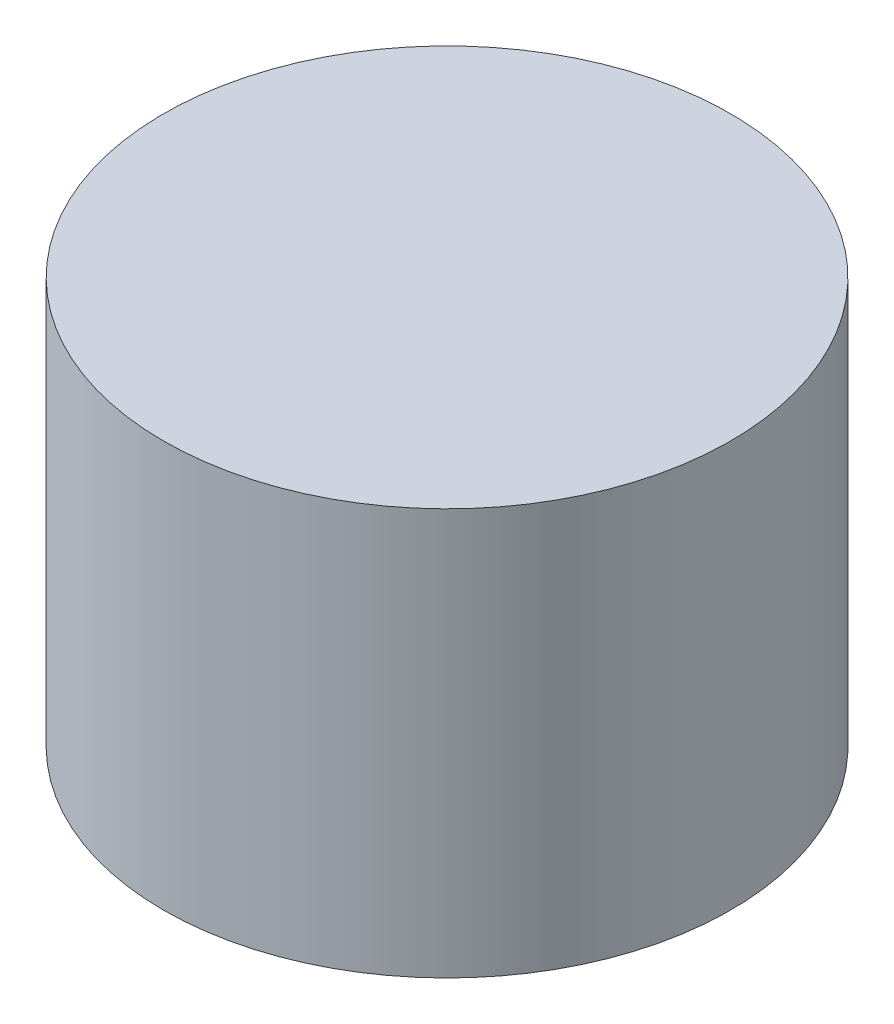
ISO-10303-21;
HEADER;
FILE_DESCRIPTION(('STEP AP214'),'2;1');
FILE_NAME('part.step','',(''),(''),'','','');
FILE_SCHEMA(('AUTOMOTIVE_DESIGN { 1 0 10303 214 1 1 1 1 }'));
ENDSEC;
DATA;
#1=APPLICATION_CONTEXT('core data for automotive mechanical design processes');
#2=APPLICATION_PROTOCOL_DEFINITION('international standard','automotive_design',2000,#1);
#3=PRODUCT_CONTEXT('',#1,'mechanical');
#4=PRODUCT('Part','Part','',(#3));
#5=PRODUCT_RELATED_PRODUCT_CATEGORY('part','',(#4));
#6=PRODUCT_DEFINITION_FORMATION('','',#4);
#7=PRODUCT_DEFINITION_CONTEXT('part definition',#1,'design');
#8=PRODUCT_DEFINITION('design','',#6,#7);
#9=PRODUCT_DEFINITION_SHAPE('','',#8);
#10=(LENGTH_UNIT() NAMED_UNIT(*) SI_UNIT(.MILLI.,.METRE.));
#11=(NAMED_UNIT(*) PLANE_ANGLE_UNIT() SI_UNIT($,.RADIAN.));
#12=(NAMED_UNIT(*) SI_UNIT($,.STERADIAN.) SOLID_ANGLE_UNIT());
#13=UNCERTAINTY_MEASURE_WITH_UNIT(LENGTH_MEASURE(1.E-05),#10,'distance_accuracy_value','');
#14=(GEOMETRIC_REPRESENTATION_CONTEXT(3) GLOBAL_UNCERTAINTY_ASSIGNED_CONTEXT((#13)) GLOBAL_UNIT_ASSIGNED_CONTEXT((#10,
#11,#12)) REPRESENTATION_CONTEXT('',''));
#15=CARTESIAN_POINT('',(0.,0.,0.));
#16=DIRECTION('',(0.,0.,1.));
#17=DIRECTION('',(1.,0.,0.));
#18=AXIS2_PLACEMENT_3D('',#15,#16,#17);
#19=CARTESIAN_POINT('',(0.,21.5,0.));
#20=DIRECTION('',(0.,-1.,0.));
#21=DIRECTION('',(0.,0.,-1.));
#22=AXIS2_PLACEMENT_3D('',#19,#20,#21);
#23=CYLINDRICAL_SURFACE('',#22,15.);
#24=CARTESIAN_POINT('',(0.,21.5,0.));
#25=DIRECTION('',(0.,1.,0.));
#26=DIRECTION('',(0.,0.,1.));
#27=AXIS2_PLACEMENT_3D('',#24,#25,#26);
#28=CIRCLE('',#27,15.);
#29=CARTESIAN_POINT('',(0.,21.5,15.));
#30=VERTEX_POINT('',#29);
#31=EDGE_CURVE('E10',#30,#30,#28,.T.);
#32=ORIENTED_EDGE('',*,*,#31,.F.);
#33=EDGE_LOOP('',(#32));
#34=FACE_BOUND('',#33,.T.);
#35=CARTESIAN_POINT('',(0.,0.,0.));
#36=DIRECTION('',(0.,1.,0.));
#37=DIRECTION('',(0.,0.,1.));
#38=AXIS2_PLACEMENT_3D('',#35,#36,#37);
#39=CIRCLE('',#38,15.);
#40=CARTESIAN_POINT('',(0.,0.,15.));
#41=VERTEX_POINT('',#40);
#42=EDGE_CURVE('E35',#41,#41,#39,.T.);
#43=ORIENTED_EDGE('',*,*,#42,.T.);
#44=EDGE_LOOP('',(#43));
#45=FACE_BOUND('',#44,.T.);
#46=ADVANCED_FACE('F32',(#34,#45),#23,.T.);
#47=CARTESIAN_POINT('',(0.,21.5,0.));
#48=DIRECTION('',(0.,1.,0.));
#49=DIRECTION('',(0.,0.,1.));
#50=AXIS2_PLACEMENT_3D('',#47,#48,#49);
#51=PLANE('',#50);
#52=ORIENTED_EDGE('',*,*,#31,.T.);
#53=EDGE_LOOP('',(#52));
#54=FACE_BOUND('',#53,.T.);
#55=ADVANCED_FACE('F47',(#54),#51,.T.);
#56=CARTESIAN_POINT('',(0.,0.,0.));
#57=DIRECTION('',(0.,1.,0.));
#58=DIRECTION('',(0.,0.,1.));
#59=AXIS2_PLACEMENT_3D('',#56,#57,#58);
#60=PLANE('',#59);
#61=ORIENTED_EDGE('',*,*,#42,.F.);
#62=EDGE_LOOP('',(#61));
#63=FACE_BOUND('',#62,.T.);
#64=ADVANCED_FACE('F45',(#63),#60,.F.);
#65=CLOSED_SHELL('',(#46,#55,#64));
#66=MANIFOLD_SOLID_BREP('B2',#65);
#67=ADVANCED_BREP_SHAPE_REPRESENTATION('',(#18,#66),#14);
#68=SHAPE_DEFINITION_REPRESENTATION(#9,#67);
ENDSEC;
END-ISO-10303-21;
